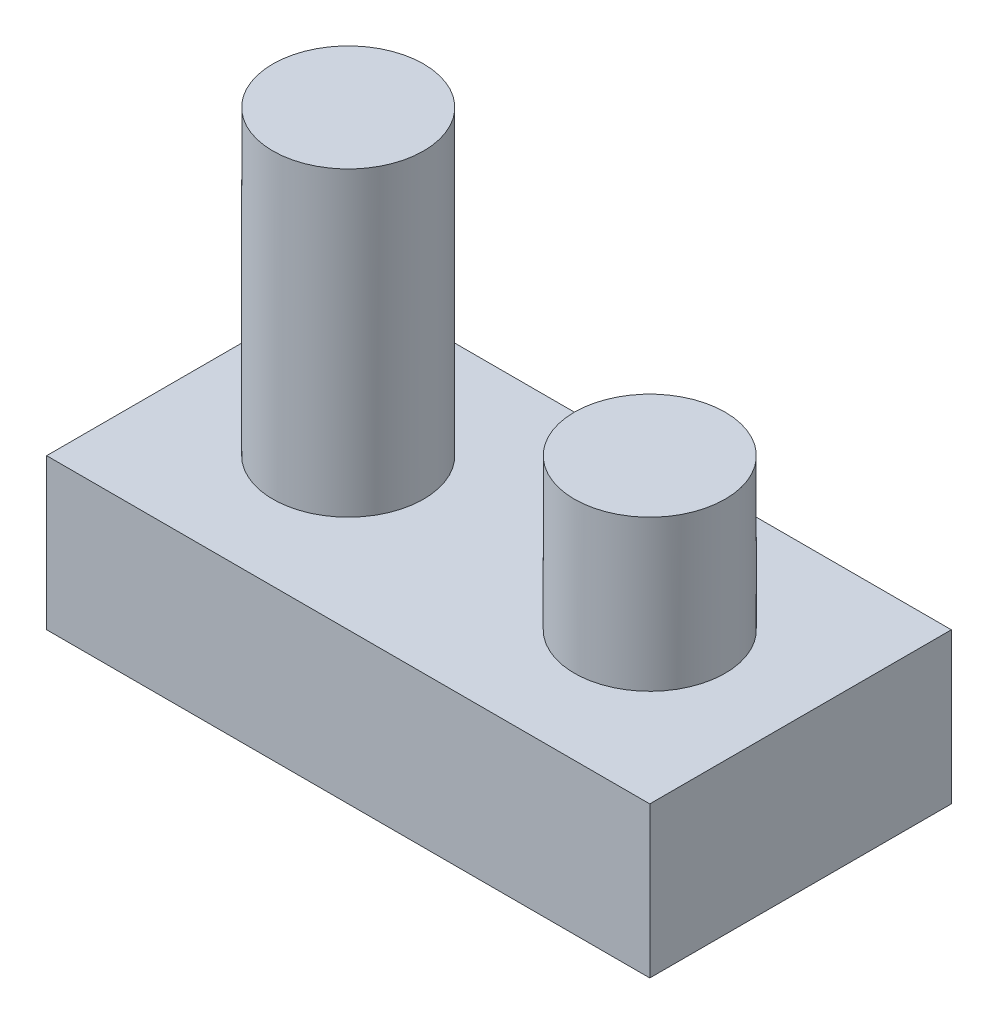
ISO-10303-21;
HEADER;
FILE_DESCRIPTION(('STEP AP214'),'2;1');
FILE_NAME('part.step','',(''),(''),'','','');
FILE_SCHEMA(('AUTOMOTIVE_DESIGN { 1 0 10303 214 1 1 1 1 }'));
ENDSEC;
DATA;
#1=APPLICATION_CONTEXT('core data for automotive mechanical design processes');
#2=APPLICATION_PROTOCOL_DEFINITION('international standard','automotive_design',2000,#1);
#3=PRODUCT_CONTEXT('',#1,'mechanical');
#4=PRODUCT('Part','Part','',(#3));
#5=PRODUCT_RELATED_PRODUCT_CATEGORY('part','',(#4));
#6=PRODUCT_DEFINITION_FORMATION('','',#4);
#7=PRODUCT_DEFINITION_CONTEXT('part definition',#1,'design');
#8=PRODUCT_DEFINITION('design','',#6,#7);
#9=PRODUCT_DEFINITION_SHAPE('','',#8);
#10=(LENGTH_UNIT() NAMED_UNIT(*) SI_UNIT(.MILLI.,.METRE.));
#11=(NAMED_UNIT(*) PLANE_ANGLE_UNIT() SI_UNIT($,.RADIAN.));
#12=(NAMED_UNIT(*) SI_UNIT($,.STERADIAN.) SOLID_ANGLE_UNIT());
#13=UNCERTAINTY_MEASURE_WITH_UNIT(LENGTH_MEASURE(1.E-05),#10,'distance_accuracy_value','');
#14=(GEOMETRIC_REPRESENTATION_CONTEXT(3) GLOBAL_UNCERTAINTY_ASSIGNED_CONTEXT((#13)) GLOBAL_UNIT_ASSIGNED_CONTEXT((#10,
#11,#12)) REPRESENTATION_CONTEXT('',''));
#15=CARTESIAN_POINT('',(0.,0.,0.));
#16=DIRECTION('',(0.,0.,1.));
#17=DIRECTION('',(1.,0.,0.));
#18=AXIS2_PLACEMENT_3D('',#15,#16,#17);
#19=CARTESIAN_POINT('',(25.4,12.7,12.7));
#20=DIRECTION('',(-1.,0.,0.));
#21=DIRECTION('',(0.,0.,1.));
#22=AXIS2_PLACEMENT_3D('',#19,#20,#21);
#23=PLANE('',#22);
#24=DIRECTION('',(0.,0.,-1.));
#25=VECTOR('',#24,1.);
#26=CARTESIAN_POINT('',(25.4,0.,12.7));
#27=LINE('',#26,#25);
#28=CARTESIAN_POINT('',(25.4,0.,12.7));
#29=VERTEX_POINT('',#28);
#30=CARTESIAN_POINT('',(25.4,0.,-12.7));
#31=VERTEX_POINT('',#30);
#32=EDGE_CURVE('E113',#29,#31,#27,.T.);
#33=ORIENTED_EDGE('',*,*,#32,.T.);
#34=DIRECTION('',(0.,-1.,0.));
#35=VECTOR('',#34,1.);
#36=CARTESIAN_POINT('',(25.4,12.7,-12.7));
#37=LINE('',#36,#35);
#38=CARTESIAN_POINT('',(25.4,12.7,-12.7));
#39=VERTEX_POINT('',#38);
#40=EDGE_CURVE('E101',#39,#31,#37,.T.);
#41=ORIENTED_EDGE('',*,*,#40,.F.);
#42=DIRECTION('',(0.,0.,-1.));
#43=VECTOR('',#42,1.);
#44=CARTESIAN_POINT('',(25.4,12.7,12.7));
#45=LINE('',#44,#43);
#46=CARTESIAN_POINT('',(25.4,12.7,12.7));
#47=VERTEX_POINT('',#46);
#48=EDGE_CURVE('E93',#47,#39,#45,.T.);
#49=ORIENTED_EDGE('',*,*,#48,.F.);
#50=DIRECTION('',(0.,-1.,0.));
#51=VECTOR('',#50,1.);
#52=CARTESIAN_POINT('',(25.4,12.7,12.7));
#53=LINE('',#52,#51);
#54=EDGE_CURVE('E109',#47,#29,#53,.T.);
#55=ORIENTED_EDGE('',*,*,#54,.T.);
#56=EDGE_LOOP('',(#33,#41,#49,#55));
#57=FACE_BOUND('',#56,.T.);
#58=ADVANCED_FACE('F40',(#57),#23,.F.);
#59=CARTESIAN_POINT('',(-25.4,12.7,-12.7));
#60=DIRECTION('',(0.,0.,1.));
#61=DIRECTION('',(1.,0.,0.));
#62=AXIS2_PLACEMENT_3D('',#59,#60,#61);
#63=PLANE('',#62);
#64=DIRECTION('',(-1.,0.,0.));
#65=VECTOR('',#64,1.);
#66=CARTESIAN_POINT('',(-25.4,0.,-12.7));
#67=LINE('',#66,#65);
#68=CARTESIAN_POINT('',(-25.4,0.,-12.7));
#69=VERTEX_POINT('',#68);
#70=EDGE_CURVE('E99',#31,#69,#67,.T.);
#71=ORIENTED_EDGE('',*,*,#70,.T.);
#72=DIRECTION('',(0.,-1.,0.));
#73=VECTOR('',#72,1.);
#74=CARTESIAN_POINT('',(-25.4,12.7,-12.7));
#75=LINE('',#74,#73);
#76=CARTESIAN_POINT('',(-25.4,12.7,-12.7));
#77=VERTEX_POINT('',#76);
#78=EDGE_CURVE('E97',#77,#69,#75,.T.);
#79=ORIENTED_EDGE('',*,*,#78,.F.);
#80=DIRECTION('',(-1.,0.,0.));
#81=VECTOR('',#80,1.);
#82=CARTESIAN_POINT('',(-25.4,12.7,-12.7));
#83=LINE('',#82,#81);
#84=EDGE_CURVE('E88',#39,#77,#83,.T.);
#85=ORIENTED_EDGE('',*,*,#84,.F.);
#86=ORIENTED_EDGE('',*,*,#40,.T.);
#87=EDGE_LOOP('',(#71,#79,#85,#86));
#88=FACE_BOUND('',#87,.T.);
#89=ADVANCED_FACE('F98',(#88),#63,.F.);
#90=CARTESIAN_POINT('',(-25.4,12.7,12.7));
#91=DIRECTION('',(1.,0.,0.));
#92=DIRECTION('',(0.,0.,-1.));
#93=AXIS2_PLACEMENT_3D('',#90,#91,#92);
#94=PLANE('',#93);
#95=DIRECTION('',(0.,0.,1.));
#96=VECTOR('',#95,1.);
#97=CARTESIAN_POINT('',(-25.4,0.,12.7));
#98=LINE('',#97,#96);
#99=CARTESIAN_POINT('',(-25.4,0.,12.7));
#100=VERTEX_POINT('',#99);
#101=EDGE_CURVE('E74',#69,#100,#98,.T.);
#102=ORIENTED_EDGE('',*,*,#101,.T.);
#103=DIRECTION('',(0.,-1.,0.));
#104=VECTOR('',#103,1.);
#105=CARTESIAN_POINT('',(-25.4,12.7,12.7));
#106=LINE('',#105,#104);
#107=CARTESIAN_POINT('',(-25.4,12.7,12.7));
#108=VERTEX_POINT('',#107);
#109=EDGE_CURVE('E102',#108,#100,#106,.T.);
#110=ORIENTED_EDGE('',*,*,#109,.F.);
#111=DIRECTION('',(0.,0.,1.));
#112=VECTOR('',#111,1.);
#113=CARTESIAN_POINT('',(-25.4,12.7,12.7));
#114=LINE('',#113,#112);
#115=EDGE_CURVE('E91',#77,#108,#114,.T.);
#116=ORIENTED_EDGE('',*,*,#115,.F.);
#117=ORIENTED_EDGE('',*,*,#78,.T.);
#118=EDGE_LOOP('',(#102,#110,#116,#117));
#119=FACE_BOUND('',#118,.T.);
#120=ADVANCED_FACE('F104',(#119),#94,.F.);
#121=CARTESIAN_POINT('',(-25.4,12.7,12.7));
#122=DIRECTION('',(0.,0.,-1.));
#123=DIRECTION('',(-1.,0.,0.));
#124=AXIS2_PLACEMENT_3D('',#121,#122,#123);
#125=PLANE('',#124);
#126=DIRECTION('',(1.,0.,0.));
#127=VECTOR('',#126,1.);
#128=CARTESIAN_POINT('',(-25.4,0.,12.7));
#129=LINE('',#128,#127);
#130=EDGE_CURVE('E80',#100,#29,#129,.T.);
#131=ORIENTED_EDGE('',*,*,#130,.T.);
#132=ORIENTED_EDGE('',*,*,#54,.F.);
#133=DIRECTION('',(1.,0.,0.));
#134=VECTOR('',#133,1.);
#135=CARTESIAN_POINT('',(-25.4,12.7,12.7));
#136=LINE('',#135,#134);
#137=EDGE_CURVE('E57',#108,#47,#136,.T.);
#138=ORIENTED_EDGE('',*,*,#137,.F.);
#139=ORIENTED_EDGE('',*,*,#109,.T.);
#140=EDGE_LOOP('',(#131,#132,#138,#139));
#141=FACE_BOUND('',#140,.T.);
#142=ADVANCED_FACE('F138',(#141),#125,.F.);
#143=CARTESIAN_POINT('',(0.,12.7,0.));
#144=DIRECTION('',(0.,-1.,0.));
#145=DIRECTION('',(0.,0.,-1.));
#146=AXIS2_PLACEMENT_3D('',#143,#144,#145);
#147=PLANE('',#146);
#148=CARTESIAN_POINT('',(12.7,12.7,0.));
#149=DIRECTION('',(0.,-1.,0.));
#150=DIRECTION('',(0.,0.,-1.));
#151=AXIS2_PLACEMENT_3D('',#148,#149,#150);
#152=CIRCLE('',#151,6.35);
#153=CARTESIAN_POINT('',(12.7,12.7,-6.35));
#154=VERTEX_POINT('',#153);
#155=EDGE_CURVE('E11',#154,#154,#152,.F.);
#156=ORIENTED_EDGE('',*,*,#155,.F.);
#157=EDGE_LOOP('',(#156));
#158=FACE_BOUND('',#157,.T.);
#159=CARTESIAN_POINT('',(-12.7,12.7,0.));
#160=DIRECTION('',(0.,-1.,0.));
#161=DIRECTION('',(0.,0.,-1.));
#162=AXIS2_PLACEMENT_3D('',#159,#160,#161);
#163=CIRCLE('',#162,6.35);
#164=CARTESIAN_POINT('',(-12.7,12.7,-6.35));
#165=VERTEX_POINT('',#164);
#166=EDGE_CURVE('E49',#165,#165,#163,.F.);
#167=ORIENTED_EDGE('',*,*,#166,.F.);
#168=EDGE_LOOP('',(#167));
#169=FACE_BOUND('',#168,.T.);
#170=ORIENTED_EDGE('',*,*,#48,.T.);
#171=ORIENTED_EDGE('',*,*,#84,.T.);
#172=ORIENTED_EDGE('',*,*,#115,.T.);
#173=ORIENTED_EDGE('',*,*,#137,.T.);
#174=EDGE_LOOP('',(#170,#171,#172,#173));
#175=FACE_BOUND('',#174,.T.);
#176=ADVANCED_FACE('F89',(#158,#169,#175),#147,.F.);
#177=CARTESIAN_POINT('',(0.,0.,0.));
#178=DIRECTION('',(0.,-1.,0.));
#179=DIRECTION('',(0.,0.,-1.));
#180=AXIS2_PLACEMENT_3D('',#177,#178,#179);
#181=PLANE('',#180);
#182=ORIENTED_EDGE('',*,*,#32,.F.);
#183=ORIENTED_EDGE('',*,*,#130,.F.);
#184=ORIENTED_EDGE('',*,*,#101,.F.);
#185=ORIENTED_EDGE('',*,*,#70,.F.);
#186=EDGE_LOOP('',(#182,#183,#184,#185));
#187=FACE_BOUND('',#186,.T.);
#188=ADVANCED_FACE('F137',(#187),#181,.T.);
#189=CARTESIAN_POINT('',(-12.7,38.1,0.));
#190=DIRECTION('',(0.,-1.,0.));
#191=DIRECTION('',(0.,0.,-1.));
#192=AXIS2_PLACEMENT_3D('',#189,#190,#191);
#193=CYLINDRICAL_SURFACE('',#192,6.35);
#194=CARTESIAN_POINT('',(-12.7,38.1,0.));
#195=DIRECTION('',(0.,1.,0.));
#196=DIRECTION('',(0.,0.,1.));
#197=AXIS2_PLACEMENT_3D('',#194,#195,#196);
#198=CIRCLE('',#197,6.35);
#199=CARTESIAN_POINT('',(-12.7,38.1,6.35));
#200=VERTEX_POINT('',#199);
#201=EDGE_CURVE('E117',#200,#200,#198,.T.);
#202=ORIENTED_EDGE('',*,*,#201,.F.);
#203=EDGE_LOOP('',(#202));
#204=FACE_BOUND('',#203,.T.);
#205=ORIENTED_EDGE('',*,*,#166,.T.);
#206=EDGE_LOOP('',(#205));
#207=FACE_BOUND('',#206,.T.);
#208=ADVANCED_FACE('F134',(#204,#207),#193,.T.);
#209=CARTESIAN_POINT('',(-12.7,38.1,0.));
#210=DIRECTION('',(0.,1.,0.));
#211=DIRECTION('',(0.,0.,1.));
#212=AXIS2_PLACEMENT_3D('',#209,#210,#211);
#213=PLANE('',#212);
#214=ORIENTED_EDGE('',*,*,#201,.T.);
#215=EDGE_LOOP('',(#214));
#216=FACE_BOUND('',#215,.T.);
#217=ADVANCED_FACE('F173',(#216),#213,.T.);
#218=CARTESIAN_POINT('',(12.7,25.4,0.));
#219=DIRECTION('',(0.,-1.,0.));
#220=DIRECTION('',(0.,0.,-1.));
#221=AXIS2_PLACEMENT_3D('',#218,#219,#220);
#222=CYLINDRICAL_SURFACE('',#221,6.35);
#223=CARTESIAN_POINT('',(12.7,25.4,0.));
#224=DIRECTION('',(0.,1.,0.));
#225=DIRECTION('',(0.,0.,1.));
#226=AXIS2_PLACEMENT_3D('',#223,#224,#225);
#227=CIRCLE('',#226,6.35);
#228=CARTESIAN_POINT('',(12.7,25.4,6.35));
#229=VERTEX_POINT('',#228);
#230=EDGE_CURVE('E162',#229,#229,#227,.T.);
#231=ORIENTED_EDGE('',*,*,#230,.F.);
#232=EDGE_LOOP('',(#231));
#233=FACE_BOUND('',#232,.T.);
#234=ORIENTED_EDGE('',*,*,#155,.T.);
#235=EDGE_LOOP('',(#234));
#236=FACE_BOUND('',#235,.T.);
#237=ADVANCED_FACE('F170',(#233,#236),#222,.T.);
#238=CARTESIAN_POINT('',(12.7,25.4,0.));
#239=DIRECTION('',(0.,1.,0.));
#240=DIRECTION('',(0.,0.,1.));
#241=AXIS2_PLACEMENT_3D('',#238,#239,#240);
#242=PLANE('',#241);
#243=ORIENTED_EDGE('',*,*,#230,.T.);
#244=EDGE_LOOP('',(#243));
#245=FACE_BOUND('',#244,.T.);
#246=ADVANCED_FACE('F168',(#245),#242,.T.);
#247=CLOSED_SHELL('',(#58,#89,#120,#142,#176,#188,#208,#217,#237,#246));
#248=MANIFOLD_SOLID_BREP('B2',#247);
#249=ADVANCED_BREP_SHAPE_REPRESENTATION('',(#18,#248),#14);
#250=SHAPE_DEFINITION_REPRESENTATION(#9,#249);
ENDSEC;
END-ISO-10303-21;
